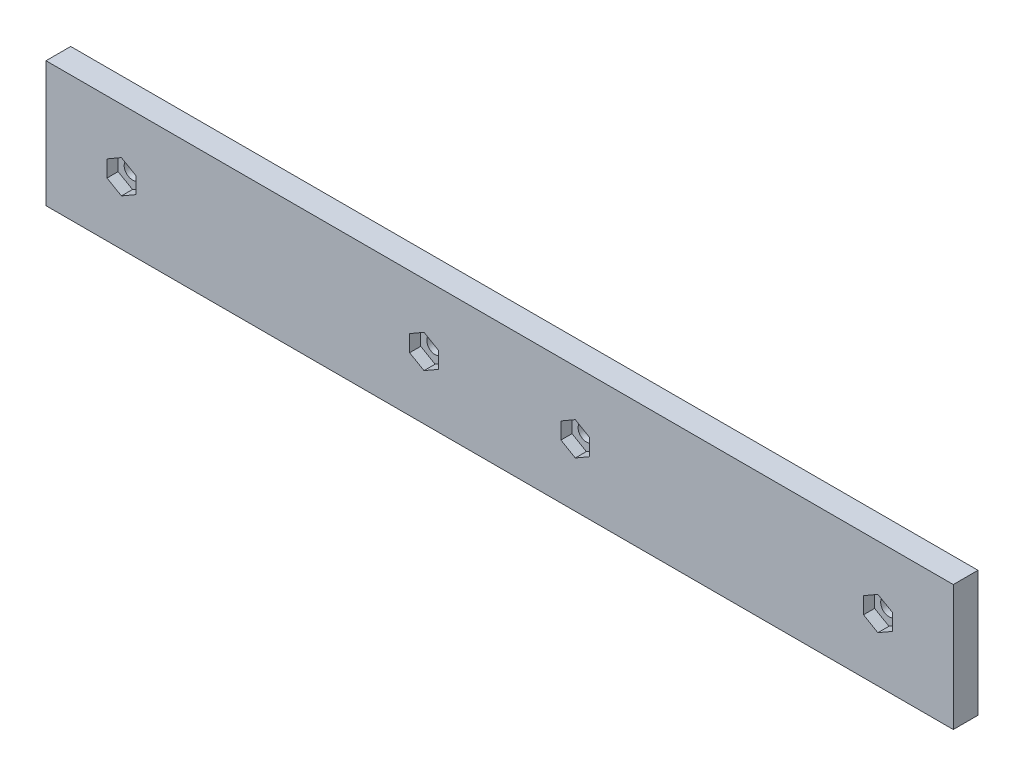
ISO-10303-21;
HEADER;
FILE_DESCRIPTION(('STEP AP214'),'2;1');
FILE_NAME('part.step','',(''),(''),'','','');
FILE_SCHEMA(('AUTOMOTIVE_DESIGN { 1 0 10303 214 1 1 1 1 }'));
ENDSEC;
DATA;
#1=APPLICATION_CONTEXT('core data for automotive mechanical design processes');
#2=APPLICATION_PROTOCOL_DEFINITION('international standard','automotive_design',2000,#1);
#3=PRODUCT_CONTEXT('',#1,'mechanical');
#4=PRODUCT('Part','Part','',(#3));
#5=PRODUCT_RELATED_PRODUCT_CATEGORY('part','',(#4));
#6=PRODUCT_DEFINITION_FORMATION('','',#4);
#7=PRODUCT_DEFINITION_CONTEXT('part definition',#1,'design');
#8=PRODUCT_DEFINITION('design','',#6,#7);
#9=PRODUCT_DEFINITION_SHAPE('','',#8);
#10=(LENGTH_UNIT() NAMED_UNIT(*) SI_UNIT(.MILLI.,.METRE.));
#11=(NAMED_UNIT(*) PLANE_ANGLE_UNIT() SI_UNIT($,.RADIAN.));
#12=(NAMED_UNIT(*) SI_UNIT($,.STERADIAN.) SOLID_ANGLE_UNIT());
#13=UNCERTAINTY_MEASURE_WITH_UNIT(LENGTH_MEASURE(1.E-05),#10,'distance_accuracy_value','');
#14=(GEOMETRIC_REPRESENTATION_CONTEXT(3) GLOBAL_UNCERTAINTY_ASSIGNED_CONTEXT((#13)) GLOBAL_UNIT_ASSIGNED_CONTEXT((#10,
#11,#12)) REPRESENTATION_CONTEXT('',''));
#15=CARTESIAN_POINT('',(0.,0.,0.));
#16=DIRECTION('',(0.,0.,1.));
#17=DIRECTION('',(1.,0.,0.));
#18=AXIS2_PLACEMENT_3D('',#15,#16,#17);
#19=CARTESIAN_POINT('',(205.907132516187,5.230027324618,4.9));
#20=DIRECTION('',(0.,0.,-1.));
#21=DIRECTION('',(-1.,0.,0.));
#22=AXIS2_PLACEMENT_3D('',#19,#20,#21);
#23=CYLINDRICAL_SURFACE('',#22,1.64999999999999);
#24=CARTESIAN_POINT('',(205.907132516187,5.230027324618,0.));
#25=DIRECTION('',(0.,0.,1.));
#26=DIRECTION('',(1.,0.,0.));
#27=AXIS2_PLACEMENT_3D('',#24,#25,#26);
#28=CIRCLE('',#27,1.64999999999999);
#29=CARTESIAN_POINT('',(207.557132516187,5.230027324618,0.));
#30=VERTEX_POINT('',#29);
#31=EDGE_CURVE('E430',#30,#30,#28,.T.);
#32=ORIENTED_EDGE('',*,*,#31,.F.);
#33=EDGE_LOOP('',(#32));
#34=FACE_BOUND('',#33,.T.);
#35=CARTESIAN_POINT('',(205.907132516187,5.230027324618,2.7));
#36=DIRECTION('',(0.,0.,1.));
#37=DIRECTION('',(1.,0.,0.));
#38=AXIS2_PLACEMENT_3D('',#35,#36,#37);
#39=CIRCLE('',#38,1.64999999999999);
#40=CARTESIAN_POINT('',(207.557132516187,5.230027324618,2.7));
#41=VERTEX_POINT('',#40);
#42=EDGE_CURVE('E39',#41,#41,#39,.T.);
#43=ORIENTED_EDGE('',*,*,#42,.T.);
#44=EDGE_LOOP('',(#43));
#45=FACE_BOUND('',#44,.T.);
#46=ADVANCED_FACE('F35',(#34,#45),#23,.F.);
#47=CARTESIAN_POINT('',(145.907132516185,5.230027324618,4.9));
#48=DIRECTION('',(0.,0.,-1.));
#49=DIRECTION('',(-1.,0.,0.));
#50=AXIS2_PLACEMENT_3D('',#47,#48,#49);
#51=CYLINDRICAL_SURFACE('',#50,1.64999999999999);
#52=CARTESIAN_POINT('',(145.907132516185,5.230027324618,0.));
#53=DIRECTION('',(0.,0.,1.));
#54=DIRECTION('',(1.,0.,0.));
#55=AXIS2_PLACEMENT_3D('',#52,#53,#54);
#56=CIRCLE('',#55,1.64999999999999);
#57=CARTESIAN_POINT('',(147.557132516185,5.230027324618,0.));
#58=VERTEX_POINT('',#57);
#59=EDGE_CURVE('E427',#58,#58,#56,.T.);
#60=ORIENTED_EDGE('',*,*,#59,.F.);
#61=EDGE_LOOP('',(#60));
#62=FACE_BOUND('',#61,.T.);
#63=CARTESIAN_POINT('',(145.907132516185,5.230027324618,2.7));
#64=DIRECTION('',(0.,0.,1.));
#65=DIRECTION('',(1.,0.,0.));
#66=AXIS2_PLACEMENT_3D('',#63,#64,#65);
#67=CIRCLE('',#66,1.64999999999999);
#68=CARTESIAN_POINT('',(147.557132516185,5.230027324618,2.7));
#69=VERTEX_POINT('',#68);
#70=EDGE_CURVE('E313',#69,#69,#67,.T.);
#71=ORIENTED_EDGE('',*,*,#70,.T.);
#72=EDGE_LOOP('',(#71));
#73=FACE_BOUND('',#72,.T.);
#74=ADVANCED_FACE('F466',(#62,#73),#51,.F.);
#75=CARTESIAN_POINT('',(115.907132516213,5.230027324618,4.9));
#76=DIRECTION('',(0.,0.,-1.));
#77=DIRECTION('',(-1.,0.,0.));
#78=AXIS2_PLACEMENT_3D('',#75,#76,#77);
#79=CYLINDRICAL_SURFACE('',#78,1.64999999999999);
#80=CARTESIAN_POINT('',(115.907132516213,5.230027324618,0.));
#81=DIRECTION('',(0.,0.,1.));
#82=DIRECTION('',(1.,0.,0.));
#83=AXIS2_PLACEMENT_3D('',#80,#81,#82);
#84=CIRCLE('',#83,1.64999999999999);
#85=CARTESIAN_POINT('',(117.557132516213,5.230027324618,0.));
#86=VERTEX_POINT('',#85);
#87=EDGE_CURVE('E424',#86,#86,#84,.T.);
#88=ORIENTED_EDGE('',*,*,#87,.F.);
#89=EDGE_LOOP('',(#88));
#90=FACE_BOUND('',#89,.T.);
#91=CARTESIAN_POINT('',(115.907132516213,5.230027324618,2.7));
#92=DIRECTION('',(0.,0.,1.));
#93=DIRECTION('',(1.,0.,0.));
#94=AXIS2_PLACEMENT_3D('',#91,#92,#93);
#95=CIRCLE('',#94,1.64999999999999);
#96=CARTESIAN_POINT('',(117.557132516213,5.230027324618,2.7));
#97=VERTEX_POINT('',#96);
#98=EDGE_CURVE('E361',#97,#97,#95,.T.);
#99=ORIENTED_EDGE('',*,*,#98,.T.);
#100=EDGE_LOOP('',(#99));
#101=FACE_BOUND('',#100,.T.);
#102=ADVANCED_FACE('F538',(#90,#101),#79,.F.);
#103=CARTESIAN_POINT('',(55.9071325162108,5.230027324618,4.9));
#104=DIRECTION('',(0.,0.,-1.));
#105=DIRECTION('',(-1.,0.,0.));
#106=AXIS2_PLACEMENT_3D('',#103,#104,#105);
#107=CYLINDRICAL_SURFACE('',#106,1.65);
#108=CARTESIAN_POINT('',(55.9071325162108,5.230027324618,0.));
#109=DIRECTION('',(0.,0.,1.));
#110=DIRECTION('',(1.,0.,0.));
#111=AXIS2_PLACEMENT_3D('',#108,#109,#110);
#112=CIRCLE('',#111,1.65);
#113=CARTESIAN_POINT('',(57.5571325162108,5.230027324618,0.));
#114=VERTEX_POINT('',#113);
#115=EDGE_CURVE('E421',#114,#114,#112,.T.);
#116=ORIENTED_EDGE('',*,*,#115,.F.);
#117=EDGE_LOOP('',(#116));
#118=FACE_BOUND('',#117,.T.);
#119=CARTESIAN_POINT('',(55.9071325162108,5.230027324618,2.7));
#120=DIRECTION('',(0.,0.,1.));
#121=DIRECTION('',(1.,0.,0.));
#122=AXIS2_PLACEMENT_3D('',#119,#120,#121);
#123=CIRCLE('',#122,1.65);
#124=CARTESIAN_POINT('',(57.5571325162108,5.230027324618,2.7));
#125=VERTEX_POINT('',#124);
#126=EDGE_CURVE('E410',#125,#125,#123,.T.);
#127=ORIENTED_EDGE('',*,*,#126,.T.);
#128=EDGE_LOOP('',(#127));
#129=FACE_BOUND('',#128,.T.);
#130=ADVANCED_FACE('F499',(#118,#129),#107,.F.);
#131=CARTESIAN_POINT('',(0.,0.,4.9));
#132=DIRECTION('',(0.,0.,1.));
#133=DIRECTION('',(1.,0.,0.));
#134=AXIS2_PLACEMENT_3D('',#131,#132,#133);
#135=PLANE('',#134);
#136=DIRECTION('',(0.866025403784439,0.5,0.));
#137=VECTOR('',#136,1.);
#138=CARTESIAN_POINT('',(205.907132516187,1.93913079023713,4.9));
#139=LINE('',#138,#137);
#140=CARTESIAN_POINT('',(205.907132516187,1.93913079023713,4.9));
#141=VERTEX_POINT('',#140);
#142=CARTESIAN_POINT('',(208.757132516187,3.58457905742758,4.9));
#143=VERTEX_POINT('',#142);
#144=EDGE_CURVE('E52',#141,#143,#139,.T.);
#145=ORIENTED_EDGE('',*,*,#144,.F.);
#146=DIRECTION('',(0.866025403784438,-0.5,0.));
#147=VECTOR('',#146,1.);
#148=CARTESIAN_POINT('',(203.057132516187,3.58457905742758,4.9));
#149=LINE('',#148,#147);
#150=CARTESIAN_POINT('',(203.057132516187,3.58457905742758,4.9));
#151=VERTEX_POINT('',#150);
#152=EDGE_CURVE('E243',#151,#141,#149,.T.);
#153=ORIENTED_EDGE('',*,*,#152,.F.);
#154=DIRECTION('',(0.,-1.,0.));
#155=VECTOR('',#154,1.);
#156=CARTESIAN_POINT('',(203.057132516187,6.87547559180849,4.9));
#157=LINE('',#156,#155);
#158=CARTESIAN_POINT('',(203.057132516187,6.87547559180849,4.9));
#159=VERTEX_POINT('',#158);
#160=EDGE_CURVE('E246',#159,#151,#157,.T.);
#161=ORIENTED_EDGE('',*,*,#160,.F.);
#162=DIRECTION('',(-0.866025403784439,-0.499999999999999,0.));
#163=VECTOR('',#162,1.);
#164=CARTESIAN_POINT('',(205.907132516187,8.52092385899894,4.9));
#165=LINE('',#164,#163);
#166=CARTESIAN_POINT('',(205.907132516187,8.52092385899894,4.9));
#167=VERTEX_POINT('',#166);
#168=EDGE_CURVE('E262',#167,#159,#165,.T.);
#169=ORIENTED_EDGE('',*,*,#168,.F.);
#170=DIRECTION('',(-0.866025403784438,0.500000000000001,0.));
#171=VECTOR('',#170,1.);
#172=CARTESIAN_POINT('',(208.757132516187,6.87547559180851,4.9));
#173=LINE('',#172,#171);
#174=CARTESIAN_POINT('',(208.757132516187,6.87547559180851,4.9));
#175=VERTEX_POINT('',#174);
#176=EDGE_CURVE('E259',#175,#167,#173,.T.);
#177=ORIENTED_EDGE('',*,*,#176,.F.);
#178=DIRECTION('',(0.,1.,0.));
#179=VECTOR('',#178,1.);
#180=CARTESIAN_POINT('',(208.757132516187,3.58457905742758,4.9));
#181=LINE('',#180,#179);
#182=EDGE_CURVE('E257',#143,#175,#181,.T.);
#183=ORIENTED_EDGE('',*,*,#182,.F.);
#184=EDGE_LOOP('',(#145,#153,#161,#169,#177,#183));
#185=FACE_BOUND('',#184,.T.);
#186=DIRECTION('',(0.866025403784439,0.499999999999999,0.));
#187=VECTOR('',#186,1.);
#188=CARTESIAN_POINT('',(145.907132516185,1.93913079023716,4.9));
#189=LINE('',#188,#187);
#190=CARTESIAN_POINT('',(145.907132516185,1.93913079023716,4.9));
#191=VERTEX_POINT('',#190);
#192=CARTESIAN_POINT('',(148.757132516185,3.58457905742758,4.9));
#193=VERTEX_POINT('',#192);
#194=EDGE_CURVE('E60',#191,#193,#189,.T.);
#195=ORIENTED_EDGE('',*,*,#194,.F.);
#196=DIRECTION('',(0.866025403784438,-0.500000000000001,0.));
#197=VECTOR('',#196,1.);
#198=CARTESIAN_POINT('',(143.057132516185,3.58457905742758,4.9));
#199=LINE('',#198,#197);
#200=CARTESIAN_POINT('',(143.057132516185,3.58457905742758,4.9));
#201=VERTEX_POINT('',#200);
#202=EDGE_CURVE('E280',#201,#191,#199,.T.);
#203=ORIENTED_EDGE('',*,*,#202,.F.);
#204=DIRECTION('',(0.,-1.,0.));
#205=VECTOR('',#204,1.);
#206=CARTESIAN_POINT('',(143.057132516185,6.87547559180841,4.9));
#207=LINE('',#206,#205);
#208=CARTESIAN_POINT('',(143.057132516185,6.87547559180841,4.9));
#209=VERTEX_POINT('',#208);
#210=EDGE_CURVE('E306',#209,#201,#207,.T.);
#211=ORIENTED_EDGE('',*,*,#210,.F.);
#212=DIRECTION('',(-0.866025403784439,-0.5,0.));
#213=VECTOR('',#212,1.);
#214=CARTESIAN_POINT('',(145.907132516185,8.52092385899882,4.9));
#215=LINE('',#214,#213);
#216=CARTESIAN_POINT('',(145.907132516185,8.52092385899882,4.9));
#217=VERTEX_POINT('',#216);
#218=EDGE_CURVE('E303',#217,#209,#215,.T.);
#219=ORIENTED_EDGE('',*,*,#218,.F.);
#220=DIRECTION('',(-0.866025403784439,0.5,0.));
#221=VECTOR('',#220,1.);
#222=CARTESIAN_POINT('',(148.757132516185,6.8754755918084,4.9));
#223=LINE('',#222,#221);
#224=CARTESIAN_POINT('',(148.757132516185,6.8754755918084,4.9));
#225=VERTEX_POINT('',#224);
#226=EDGE_CURVE('E300',#225,#217,#223,.T.);
#227=ORIENTED_EDGE('',*,*,#226,.F.);
#228=DIRECTION('',(0.,1.,0.));
#229=VECTOR('',#228,1.);
#230=CARTESIAN_POINT('',(148.757132516185,3.58457905742758,4.9));
#231=LINE('',#230,#229);
#232=EDGE_CURVE('E297',#193,#225,#231,.T.);
#233=ORIENTED_EDGE('',*,*,#232,.F.);
#234=EDGE_LOOP('',(#195,#203,#211,#219,#227,#233));
#235=FACE_BOUND('',#234,.T.);
#236=DIRECTION('',(0.866025403784439,0.5,0.));
#237=VECTOR('',#236,1.);
#238=CARTESIAN_POINT('',(115.907132516213,1.93913079023714,4.9));
#239=LINE('',#238,#237);
#240=CARTESIAN_POINT('',(115.907132516213,1.93913079023714,4.9));
#241=VERTEX_POINT('',#240);
#242=CARTESIAN_POINT('',(118.757132516213,3.58457905742758,4.9));
#243=VERTEX_POINT('',#242);
#244=EDGE_CURVE('E343',#241,#243,#239,.T.);
#245=ORIENTED_EDGE('',*,*,#244,.F.);
#246=DIRECTION('',(0.866025403784438,-0.5,0.));
#247=VECTOR('',#246,1.);
#248=CARTESIAN_POINT('',(113.057132516213,3.58457905742757,4.9));
#249=LINE('',#248,#247);
#250=CARTESIAN_POINT('',(113.057132516213,3.58457905742757,4.9));
#251=VERTEX_POINT('',#250);
#252=EDGE_CURVE('E327',#251,#241,#249,.T.);
#253=ORIENTED_EDGE('',*,*,#252,.F.);
#254=DIRECTION('',(0.,-1.,0.));
#255=VECTOR('',#254,1.);
#256=CARTESIAN_POINT('',(113.057132516213,6.87547559180845,4.9));
#257=LINE('',#256,#255);
#258=CARTESIAN_POINT('',(113.057132516213,6.87547559180845,4.9));
#259=VERTEX_POINT('',#258);
#260=EDGE_CURVE('E354',#259,#251,#257,.T.);
#261=ORIENTED_EDGE('',*,*,#260,.F.);
#262=DIRECTION('',(-0.866025403784439,-0.5,0.));
#263=VECTOR('',#262,1.);
#264=CARTESIAN_POINT('',(115.907132516213,8.5209238589989,4.9));
#265=LINE('',#264,#263);
#266=CARTESIAN_POINT('',(115.907132516213,8.5209238589989,4.9));
#267=VERTEX_POINT('',#266);
#268=EDGE_CURVE('E351',#267,#259,#265,.T.);
#269=ORIENTED_EDGE('',*,*,#268,.F.);
#270=DIRECTION('',(-0.866025403784438,0.5,0.));
#271=VECTOR('',#270,1.);
#272=CARTESIAN_POINT('',(118.757132516213,6.87547559180846,4.9));
#273=LINE('',#272,#271);
#274=CARTESIAN_POINT('',(118.757132516213,6.87547559180846,4.9));
#275=VERTEX_POINT('',#274);
#276=EDGE_CURVE('E348',#275,#267,#273,.T.);
#277=ORIENTED_EDGE('',*,*,#276,.F.);
#278=DIRECTION('',(0.,1.,0.));
#279=VECTOR('',#278,1.);
#280=CARTESIAN_POINT('',(118.757132516213,3.58457905742758,4.9));
#281=LINE('',#280,#279);
#282=EDGE_CURVE('E345',#243,#275,#281,.T.);
#283=ORIENTED_EDGE('',*,*,#282,.F.);
#284=EDGE_LOOP('',(#245,#253,#261,#269,#277,#283));
#285=FACE_BOUND('',#284,.T.);
#286=DIRECTION('',(0.866025403784438,0.5,0.));
#287=VECTOR('',#286,1.);
#288=CARTESIAN_POINT('',(55.9071325162108,1.93913079023713,4.9));
#289=LINE('',#288,#287);
#290=CARTESIAN_POINT('',(55.9071325162108,1.93913079023713,4.9));
#291=VERTEX_POINT('',#290);
#292=CARTESIAN_POINT('',(58.7571325162108,3.58457905742757,4.9));
#293=VERTEX_POINT('',#292);
#294=EDGE_CURVE('E392',#291,#293,#289,.T.);
#295=ORIENTED_EDGE('',*,*,#294,.F.);
#296=DIRECTION('',(0.866025403784439,-0.5,0.));
#297=VECTOR('',#296,1.);
#298=CARTESIAN_POINT('',(53.0571325162108,3.58457905742756,4.9));
#299=LINE('',#298,#297);
#300=CARTESIAN_POINT('',(53.0571325162108,3.58457905742756,4.9));
#301=VERTEX_POINT('',#300);
#302=EDGE_CURVE('E376',#301,#291,#299,.T.);
#303=ORIENTED_EDGE('',*,*,#302,.F.);
#304=DIRECTION('',(0.,-1.,0.));
#305=VECTOR('',#304,1.);
#306=CARTESIAN_POINT('',(53.0571325162108,6.87547559180844,4.9));
#307=LINE('',#306,#305);
#308=CARTESIAN_POINT('',(53.0571325162108,6.87547559180844,4.9));
#309=VERTEX_POINT('',#308);
#310=EDGE_CURVE('E403',#309,#301,#307,.T.);
#311=ORIENTED_EDGE('',*,*,#310,.F.);
#312=DIRECTION('',(-0.866025403784439,-0.5,0.));
#313=VECTOR('',#312,1.);
#314=CARTESIAN_POINT('',(55.9071325162108,8.52092385899887,4.9));
#315=LINE('',#314,#313);
#316=CARTESIAN_POINT('',(55.9071325162108,8.52092385899887,4.9));
#317=VERTEX_POINT('',#316);
#318=EDGE_CURVE('E400',#317,#309,#315,.T.);
#319=ORIENTED_EDGE('',*,*,#318,.F.);
#320=DIRECTION('',(-0.866025403784438,0.5,0.));
#321=VECTOR('',#320,1.);
#322=CARTESIAN_POINT('',(58.7571325162108,6.87547559180843,4.9));
#323=LINE('',#322,#321);
#324=CARTESIAN_POINT('',(58.7571325162108,6.87547559180843,4.9));
#325=VERTEX_POINT('',#324);
#326=EDGE_CURVE('E397',#325,#317,#323,.T.);
#327=ORIENTED_EDGE('',*,*,#326,.F.);
#328=DIRECTION('',(0.,1.,0.));
#329=VECTOR('',#328,1.);
#330=CARTESIAN_POINT('',(58.7571325162108,3.58457905742757,4.9));
#331=LINE('',#330,#329);
#332=EDGE_CURVE('E394',#293,#325,#331,.T.);
#333=ORIENTED_EDGE('',*,*,#332,.F.);
#334=EDGE_LOOP('',(#295,#303,#311,#319,#327,#333));
#335=FACE_BOUND('',#334,.T.);
#336=DIRECTION('',(0.,1.,0.));
#337=VECTOR('',#336,1.);
#338=CARTESIAN_POINT('',(220.857132516199,-7.21997267538202,4.9));
#339=LINE('',#338,#337);
#340=CARTESIAN_POINT('',(220.857132516199,-7.21997267538202,4.9));
#341=VERTEX_POINT('',#340);
#342=CARTESIAN_POINT('',(220.857132516199,17.680027324618,4.9));
#343=VERTEX_POINT('',#342);
#344=EDGE_CURVE('E434',#341,#343,#339,.T.);
#345=ORIENTED_EDGE('',*,*,#344,.T.);
#346=DIRECTION('',(-1.,0.,0.));
#347=VECTOR('',#346,1.);
#348=CARTESIAN_POINT('',(220.857132516199,17.680027324618,4.9));
#349=LINE('',#348,#347);
#350=CARTESIAN_POINT('',(40.9571325161992,17.680027324618,4.9));
#351=VERTEX_POINT('',#350);
#352=EDGE_CURVE('E437',#343,#351,#349,.T.);
#353=ORIENTED_EDGE('',*,*,#352,.T.);
#354=DIRECTION('',(0.,-1.,0.));
#355=VECTOR('',#354,1.);
#356=CARTESIAN_POINT('',(40.9571325161992,-7.21997267538202,4.9));
#357=LINE('',#356,#355);
#358=CARTESIAN_POINT('',(40.9571325161992,-7.21997267538202,4.9));
#359=VERTEX_POINT('',#358);
#360=EDGE_CURVE('E440',#351,#359,#357,.T.);
#361=ORIENTED_EDGE('',*,*,#360,.T.);
#362=DIRECTION('',(1.,0.,0.));
#363=VECTOR('',#362,1.);
#364=CARTESIAN_POINT('',(220.857132516199,-7.21997267538202,4.9));
#365=LINE('',#364,#363);
#366=EDGE_CURVE('E442',#359,#341,#365,.T.);
#367=ORIENTED_EDGE('',*,*,#366,.T.);
#368=EDGE_LOOP('',(#345,#353,#361,#367));
#369=FACE_BOUND('',#368,.T.);
#370=ADVANCED_FACE('F495',(#185,#235,#285,#335,#369),#135,.T.);
#371=CARTESIAN_POINT('',(0.,0.,0.));
#372=DIRECTION('',(0.,0.,1.));
#373=DIRECTION('',(1.,0.,0.));
#374=AXIS2_PLACEMENT_3D('',#371,#372,#373);
#375=PLANE('',#374);
#376=ORIENTED_EDGE('',*,*,#87,.T.);
#377=EDGE_LOOP('',(#376));
#378=FACE_BOUND('',#377,.T.);
#379=ORIENTED_EDGE('',*,*,#31,.T.);
#380=EDGE_LOOP('',(#379));
#381=FACE_BOUND('',#380,.T.);
#382=DIRECTION('',(0.,1.,0.));
#383=VECTOR('',#382,1.);
#384=CARTESIAN_POINT('',(220.857132516199,-7.21997267538202,0.));
#385=LINE('',#384,#383);
#386=CARTESIAN_POINT('',(220.857132516199,-7.21997267538202,0.));
#387=VERTEX_POINT('',#386);
#388=CARTESIAN_POINT('',(220.857132516199,17.680027324618,0.));
#389=VERTEX_POINT('',#388);
#390=EDGE_CURVE('E433',#387,#389,#385,.T.);
#391=ORIENTED_EDGE('',*,*,#390,.F.);
#392=DIRECTION('',(1.,0.,0.));
#393=VECTOR('',#392,1.);
#394=CARTESIAN_POINT('',(220.857132516199,-7.21997267538202,0.));
#395=LINE('',#394,#393);
#396=CARTESIAN_POINT('',(40.9571325161992,-7.21997267538202,0.));
#397=VERTEX_POINT('',#396);
#398=EDGE_CURVE('E438',#397,#387,#395,.T.);
#399=ORIENTED_EDGE('',*,*,#398,.F.);
#400=DIRECTION('',(0.,-1.,0.));
#401=VECTOR('',#400,1.);
#402=CARTESIAN_POINT('',(40.9571325161992,-7.21997267538202,0.));
#403=LINE('',#402,#401);
#404=CARTESIAN_POINT('',(40.9571325161992,17.680027324618,0.));
#405=VERTEX_POINT('',#404);
#406=EDGE_CURVE('E450',#405,#397,#403,.T.);
#407=ORIENTED_EDGE('',*,*,#406,.F.);
#408=DIRECTION('',(-1.,0.,0.));
#409=VECTOR('',#408,1.);
#410=CARTESIAN_POINT('',(220.857132516199,17.680027324618,0.));
#411=LINE('',#410,#409);
#412=EDGE_CURVE('E448',#389,#405,#411,.T.);
#413=ORIENTED_EDGE('',*,*,#412,.F.);
#414=EDGE_LOOP('',(#391,#399,#407,#413));
#415=FACE_BOUND('',#414,.T.);
#416=ORIENTED_EDGE('',*,*,#59,.T.);
#417=EDGE_LOOP('',(#416));
#418=FACE_BOUND('',#417,.T.);
#419=ORIENTED_EDGE('',*,*,#115,.T.);
#420=EDGE_LOOP('',(#419));
#421=FACE_BOUND('',#420,.T.);
#422=ADVANCED_FACE('F498',(#378,#381,#415,#418,#421),#375,.F.);
#423=CARTESIAN_POINT('',(220.857132516199,-7.21997267538202,4.9));
#424=DIRECTION('',(-1.,0.,0.));
#425=DIRECTION('',(0.,0.,1.));
#426=AXIS2_PLACEMENT_3D('',#423,#424,#425);
#427=PLANE('',#426);
#428=ORIENTED_EDGE('',*,*,#390,.T.);
#429=DIRECTION('',(0.,0.,-1.));
#430=VECTOR('',#429,1.);
#431=CARTESIAN_POINT('',(220.857132516199,17.680027324618,4.9));
#432=LINE('',#431,#430);
#433=EDGE_CURVE('E11',#343,#389,#432,.T.);
#434=ORIENTED_EDGE('',*,*,#433,.F.);
#435=ORIENTED_EDGE('',*,*,#344,.F.);
#436=DIRECTION('',(0.,0.,-1.));
#437=VECTOR('',#436,1.);
#438=CARTESIAN_POINT('',(220.857132516199,-7.21997267538202,4.9));
#439=LINE('',#438,#437);
#440=EDGE_CURVE('E445',#341,#387,#439,.T.);
#441=ORIENTED_EDGE('',*,*,#440,.T.);
#442=EDGE_LOOP('',(#428,#434,#435,#441));
#443=FACE_BOUND('',#442,.T.);
#444=ADVANCED_FACE('F37',(#443),#427,.F.);
#445=CARTESIAN_POINT('',(220.857132516199,17.680027324618,4.9));
#446=DIRECTION('',(0.,-1.,0.));
#447=DIRECTION('',(0.,0.,-1.));
#448=AXIS2_PLACEMENT_3D('',#445,#446,#447);
#449=PLANE('',#448);
#450=ORIENTED_EDGE('',*,*,#412,.T.);
#451=DIRECTION('',(0.,0.,-1.));
#452=VECTOR('',#451,1.);
#453=CARTESIAN_POINT('',(40.9571325161992,17.680027324618,4.9));
#454=LINE('',#453,#452);
#455=EDGE_CURVE('E44',#351,#405,#454,.T.);
#456=ORIENTED_EDGE('',*,*,#455,.F.);
#457=ORIENTED_EDGE('',*,*,#352,.F.);
#458=ORIENTED_EDGE('',*,*,#433,.T.);
#459=EDGE_LOOP('',(#450,#456,#457,#458));
#460=FACE_BOUND('',#459,.T.);
#461=ADVANCED_FACE('F518',(#460),#449,.F.);
#462=CARTESIAN_POINT('',(40.9571325161992,-7.21997267538202,4.9));
#463=DIRECTION('',(1.,0.,0.));
#464=DIRECTION('',(0.,0.,-1.));
#465=AXIS2_PLACEMENT_3D('',#462,#463,#464);
#466=PLANE('',#465);
#467=ORIENTED_EDGE('',*,*,#406,.T.);
#468=DIRECTION('',(0.,0.,-1.));
#469=VECTOR('',#468,1.);
#470=CARTESIAN_POINT('',(40.9571325161992,-7.21997267538202,4.9));
#471=LINE('',#470,#469);
#472=EDGE_CURVE('E455',#359,#397,#471,.T.);
#473=ORIENTED_EDGE('',*,*,#472,.F.);
#474=ORIENTED_EDGE('',*,*,#360,.F.);
#475=ORIENTED_EDGE('',*,*,#455,.T.);
#476=EDGE_LOOP('',(#467,#473,#474,#475));
#477=FACE_BOUND('',#476,.T.);
#478=ADVANCED_FACE('F523',(#477),#466,.F.);
#479=CARTESIAN_POINT('',(220.857132516199,-7.21997267538202,4.9));
#480=DIRECTION('',(0.,1.,0.));
#481=DIRECTION('',(0.,0.,1.));
#482=AXIS2_PLACEMENT_3D('',#479,#480,#481);
#483=PLANE('',#482);
#484=ORIENTED_EDGE('',*,*,#398,.T.);
#485=ORIENTED_EDGE('',*,*,#440,.F.);
#486=ORIENTED_EDGE('',*,*,#366,.F.);
#487=ORIENTED_EDGE('',*,*,#472,.T.);
#488=EDGE_LOOP('',(#484,#485,#486,#487));
#489=FACE_BOUND('',#488,.T.);
#490=ADVANCED_FACE('F526',(#489),#483,.F.);
#491=CARTESIAN_POINT('',(55.9071325162108,1.93913079023713,2.7));
#492=DIRECTION('',(0.5,-0.866025403784439,0.));
#493=DIRECTION('',(0.866025403784438,0.5,0.));
#494=AXIS2_PLACEMENT_3D('',#491,#492,#493);
#495=PLANE('',#494);
#496=ORIENTED_EDGE('',*,*,#294,.T.);
#497=DIRECTION('',(0.,0.,1.));
#498=VECTOR('',#497,1.);
#499=CARTESIAN_POINT('',(58.7571325162108,3.58457905742757,2.7));
#500=LINE('',#499,#498);
#501=CARTESIAN_POINT('',(58.7571325162108,3.58457905742757,2.7));
#502=VERTEX_POINT('',#501);
#503=EDGE_CURVE('E391',#502,#293,#500,.T.);
#504=ORIENTED_EDGE('',*,*,#503,.F.);
#505=DIRECTION('',(0.866025403784438,0.5,0.));
#506=VECTOR('',#505,1.);
#507=CARTESIAN_POINT('',(55.9071325162108,1.93913079023713,2.7));
#508=LINE('',#507,#506);
#509=CARTESIAN_POINT('',(55.9071325162108,1.93913079023713,2.7));
#510=VERTEX_POINT('',#509);
#511=EDGE_CURVE('E372',#510,#502,#508,.T.);
#512=ORIENTED_EDGE('',*,*,#511,.F.);
#513=DIRECTION('',(0.,0.,1.));
#514=VECTOR('',#513,1.);
#515=CARTESIAN_POINT('',(55.9071325162108,1.93913079023713,2.7));
#516=LINE('',#515,#514);
#517=EDGE_CURVE('E408',#510,#291,#516,.T.);
#518=ORIENTED_EDGE('',*,*,#517,.T.);
#519=EDGE_LOOP('',(#496,#504,#512,#518));
#520=FACE_BOUND('',#519,.T.);
#521=ADVANCED_FACE('F552',(#520),#495,.F.);
#522=CARTESIAN_POINT('',(53.0571325162108,3.58457905742756,2.7));
#523=DIRECTION('',(-0.5,-0.866025403784439,0.));
#524=DIRECTION('',(0.866025403784439,-0.5,0.));
#525=AXIS2_PLACEMENT_3D('',#522,#523,#524);
#526=PLANE('',#525);
#527=ORIENTED_EDGE('',*,*,#302,.T.);
#528=ORIENTED_EDGE('',*,*,#517,.F.);
#529=DIRECTION('',(0.866025403784439,-0.5,0.));
#530=VECTOR('',#529,1.);
#531=CARTESIAN_POINT('',(53.0571325162108,3.58457905742756,2.7));
#532=LINE('',#531,#530);
#533=CARTESIAN_POINT('',(53.0571325162108,3.58457905742756,2.7));
#534=VERTEX_POINT('',#533);
#535=EDGE_CURVE('E388',#534,#510,#532,.T.);
#536=ORIENTED_EDGE('',*,*,#535,.F.);
#537=DIRECTION('',(0.,0.,1.));
#538=VECTOR('',#537,1.);
#539=CARTESIAN_POINT('',(53.0571325162108,3.58457905742756,2.7));
#540=LINE('',#539,#538);
#541=EDGE_CURVE('E411',#534,#301,#540,.T.);
#542=ORIENTED_EDGE('',*,*,#541,.T.);
#543=EDGE_LOOP('',(#527,#528,#536,#542));
#544=FACE_BOUND('',#543,.T.);
#545=ADVANCED_FACE('F567',(#544),#526,.F.);
#546=CARTESIAN_POINT('',(53.0571325162108,6.87547559180844,2.7));
#547=DIRECTION('',(-1.,0.,0.));
#548=DIRECTION('',(0.,0.,1.));
#549=AXIS2_PLACEMENT_3D('',#546,#547,#548);
#550=PLANE('',#549);
#551=ORIENTED_EDGE('',*,*,#310,.T.);
#552=ORIENTED_EDGE('',*,*,#541,.F.);
#553=DIRECTION('',(0.,-1.,0.));
#554=VECTOR('',#553,1.);
#555=CARTESIAN_POINT('',(53.0571325162108,6.87547559180844,2.7));
#556=LINE('',#555,#554);
#557=CARTESIAN_POINT('',(53.0571325162108,6.87547559180844,2.7));
#558=VERTEX_POINT('',#557);
#559=EDGE_CURVE('E385',#558,#534,#556,.T.);
#560=ORIENTED_EDGE('',*,*,#559,.F.);
#561=DIRECTION('',(0.,0.,1.));
#562=VECTOR('',#561,1.);
#563=CARTESIAN_POINT('',(53.0571325162108,6.87547559180844,2.7));
#564=LINE('',#563,#562);
#565=EDGE_CURVE('E413',#558,#309,#564,.T.);
#566=ORIENTED_EDGE('',*,*,#565,.T.);
#567=EDGE_LOOP('',(#551,#552,#560,#566));
#568=FACE_BOUND('',#567,.T.);
#569=ADVANCED_FACE('F565',(#568),#550,.F.);
#570=CARTESIAN_POINT('',(55.9071325162108,8.52092385899887,2.7));
#571=DIRECTION('',(-0.5,0.866025403784439,0.));
#572=DIRECTION('',(-0.866025403784439,-0.5,0.));
#573=AXIS2_PLACEMENT_3D('',#570,#571,#572);
#574=PLANE('',#573);
#575=ORIENTED_EDGE('',*,*,#318,.T.);
#576=ORIENTED_EDGE('',*,*,#565,.F.);
#577=DIRECTION('',(-0.866025403784439,-0.5,0.));
#578=VECTOR('',#577,1.);
#579=CARTESIAN_POINT('',(55.9071325162108,8.52092385899887,2.7));
#580=LINE('',#579,#578);
#581=CARTESIAN_POINT('',(55.9071325162108,8.52092385899887,2.7));
#582=VERTEX_POINT('',#581);
#583=EDGE_CURVE('E382',#582,#558,#580,.T.);
#584=ORIENTED_EDGE('',*,*,#583,.F.);
#585=DIRECTION('',(0.,0.,1.));
#586=VECTOR('',#585,1.);
#587=CARTESIAN_POINT('',(55.9071325162108,8.52092385899887,2.7));
#588=LINE('',#587,#586);
#589=EDGE_CURVE('E415',#582,#317,#588,.T.);
#590=ORIENTED_EDGE('',*,*,#589,.T.);
#591=EDGE_LOOP('',(#575,#576,#584,#590));
#592=FACE_BOUND('',#591,.T.);
#593=ADVANCED_FACE('F561',(#592),#574,.F.);
#594=CARTESIAN_POINT('',(58.7571325162108,6.87547559180843,2.7));
#595=DIRECTION('',(0.5,0.866025403784439,0.));
#596=DIRECTION('',(-0.866025403784439,0.5,0.));
#597=AXIS2_PLACEMENT_3D('',#594,#595,#596);
#598=PLANE('',#597);
#599=ORIENTED_EDGE('',*,*,#326,.T.);
#600=ORIENTED_EDGE('',*,*,#589,.F.);
#601=DIRECTION('',(-0.866025403784438,0.5,0.));
#602=VECTOR('',#601,1.);
#603=CARTESIAN_POINT('',(58.7571325162108,6.87547559180843,2.7));
#604=LINE('',#603,#602);
#605=CARTESIAN_POINT('',(58.7571325162108,6.87547559180843,2.7));
#606=VERTEX_POINT('',#605);
#607=EDGE_CURVE('E379',#606,#582,#604,.T.);
#608=ORIENTED_EDGE('',*,*,#607,.F.);
#609=DIRECTION('',(0.,0.,1.));
#610=VECTOR('',#609,1.);
#611=CARTESIAN_POINT('',(58.7571325162108,6.87547559180843,2.7));
#612=LINE('',#611,#610);
#613=EDGE_CURVE('E417',#606,#325,#612,.T.);
#614=ORIENTED_EDGE('',*,*,#613,.T.);
#615=EDGE_LOOP('',(#599,#600,#608,#614));
#616=FACE_BOUND('',#615,.T.);
#617=ADVANCED_FACE('F557',(#616),#598,.F.);
#618=CARTESIAN_POINT('',(58.7571325162108,3.58457905742757,2.7));
#619=DIRECTION('',(1.,0.,0.));
#620=DIRECTION('',(0.,0.,-1.));
#621=AXIS2_PLACEMENT_3D('',#618,#619,#620);
#622=PLANE('',#621);
#623=ORIENTED_EDGE('',*,*,#332,.T.);
#624=ORIENTED_EDGE('',*,*,#613,.F.);
#625=DIRECTION('',(0.,1.,0.));
#626=VECTOR('',#625,1.);
#627=CARTESIAN_POINT('',(58.7571325162108,3.58457905742757,2.7));
#628=LINE('',#627,#626);
#629=EDGE_CURVE('E375',#502,#606,#628,.T.);
#630=ORIENTED_EDGE('',*,*,#629,.F.);
#631=ORIENTED_EDGE('',*,*,#503,.T.);
#632=EDGE_LOOP('',(#623,#624,#630,#631));
#633=FACE_BOUND('',#632,.T.);
#634=ADVANCED_FACE('F546',(#633),#622,.F.);
#635=CARTESIAN_POINT('',(0.,0.,2.7));
#636=DIRECTION('',(0.,0.,1.));
#637=DIRECTION('',(1.,0.,0.));
#638=AXIS2_PLACEMENT_3D('',#635,#636,#637);
#639=PLANE('',#638);
#640=ORIENTED_EDGE('',*,*,#126,.F.);
#641=EDGE_LOOP('',(#640));
#642=FACE_BOUND('',#641,.T.);
#643=ORIENTED_EDGE('',*,*,#511,.T.);
#644=ORIENTED_EDGE('',*,*,#629,.T.);
#645=ORIENTED_EDGE('',*,*,#607,.T.);
#646=ORIENTED_EDGE('',*,*,#583,.T.);
#647=ORIENTED_EDGE('',*,*,#559,.T.);
#648=ORIENTED_EDGE('',*,*,#535,.T.);
#649=EDGE_LOOP('',(#643,#644,#645,#646,#647,#648));
#650=FACE_BOUND('',#649,.T.);
#651=ADVANCED_FACE('F542',(#642,#650),#639,.T.);
#652=CARTESIAN_POINT('',(115.907132516213,1.93913079023714,2.7));
#653=DIRECTION('',(0.5,-0.866025403784439,0.));
#654=DIRECTION('',(0.866025403784439,0.5,0.));
#655=AXIS2_PLACEMENT_3D('',#652,#653,#654);
#656=PLANE('',#655);
#657=ORIENTED_EDGE('',*,*,#244,.T.);
#658=DIRECTION('',(0.,0.,1.));
#659=VECTOR('',#658,1.);
#660=CARTESIAN_POINT('',(118.757132516213,3.58457905742758,2.7));
#661=LINE('',#660,#659);
#662=CARTESIAN_POINT('',(118.757132516213,3.58457905742758,2.7));
#663=VERTEX_POINT('',#662);
#664=EDGE_CURVE('E342',#663,#243,#661,.T.);
#665=ORIENTED_EDGE('',*,*,#664,.F.);
#666=DIRECTION('',(0.866025403784439,0.5,0.));
#667=VECTOR('',#666,1.);
#668=CARTESIAN_POINT('',(115.907132516213,1.93913079023714,2.7));
#669=LINE('',#668,#667);
#670=CARTESIAN_POINT('',(115.907132516213,1.93913079023714,2.7));
#671=VERTEX_POINT('',#670);
#672=EDGE_CURVE('E323',#671,#663,#669,.T.);
#673=ORIENTED_EDGE('',*,*,#672,.F.);
#674=DIRECTION('',(0.,0.,1.));
#675=VECTOR('',#674,1.);
#676=CARTESIAN_POINT('',(115.907132516213,1.93913079023714,2.7));
#677=LINE('',#676,#675);
#678=EDGE_CURVE('E359',#671,#241,#677,.T.);
#679=ORIENTED_EDGE('',*,*,#678,.T.);
#680=EDGE_LOOP('',(#657,#665,#673,#679));
#681=FACE_BOUND('',#680,.T.);
#682=ADVANCED_FACE('F545',(#681),#656,.F.);
#683=CARTESIAN_POINT('',(113.057132516213,3.58457905742757,2.7));
#684=DIRECTION('',(-0.5,-0.866025403784439,0.));
#685=DIRECTION('',(0.866025403784439,-0.5,0.));
#686=AXIS2_PLACEMENT_3D('',#683,#684,#685);
#687=PLANE('',#686);
#688=ORIENTED_EDGE('',*,*,#252,.T.);
#689=ORIENTED_EDGE('',*,*,#678,.F.);
#690=DIRECTION('',(0.866025403784438,-0.5,0.));
#691=VECTOR('',#690,1.);
#692=CARTESIAN_POINT('',(113.057132516213,3.58457905742757,2.7));
#693=LINE('',#692,#691);
#694=CARTESIAN_POINT('',(113.057132516213,3.58457905742757,2.7));
#695=VERTEX_POINT('',#694);
#696=EDGE_CURVE('E339',#695,#671,#693,.T.);
#697=ORIENTED_EDGE('',*,*,#696,.F.);
#698=DIRECTION('',(0.,0.,1.));
#699=VECTOR('',#698,1.);
#700=CARTESIAN_POINT('',(113.057132516213,3.58457905742757,2.7));
#701=LINE('',#700,#699);
#702=EDGE_CURVE('E362',#695,#251,#701,.T.);
#703=ORIENTED_EDGE('',*,*,#702,.T.);
#704=EDGE_LOOP('',(#688,#689,#697,#703));
#705=FACE_BOUND('',#704,.T.);
#706=ADVANCED_FACE('F700',(#705),#687,.F.);
#707=CARTESIAN_POINT('',(113.057132516213,6.87547559180845,2.7));
#708=DIRECTION('',(-1.,0.,0.));
#709=DIRECTION('',(0.,0.,1.));
#710=AXIS2_PLACEMENT_3D('',#707,#708,#709);
#711=PLANE('',#710);
#712=ORIENTED_EDGE('',*,*,#260,.T.);
#713=ORIENTED_EDGE('',*,*,#702,.F.);
#714=DIRECTION('',(0.,-1.,0.));
#715=VECTOR('',#714,1.);
#716=CARTESIAN_POINT('',(113.057132516213,6.87547559180845,2.7));
#717=LINE('',#716,#715);
#718=CARTESIAN_POINT('',(113.057132516213,6.87547559180845,2.7));
#719=VERTEX_POINT('',#718);
#720=EDGE_CURVE('E336',#719,#695,#717,.T.);
#721=ORIENTED_EDGE('',*,*,#720,.F.);
#722=DIRECTION('',(0.,0.,1.));
#723=VECTOR('',#722,1.);
#724=CARTESIAN_POINT('',(113.057132516213,6.87547559180845,2.7));
#725=LINE('',#724,#723);
#726=EDGE_CURVE('E364',#719,#259,#725,.T.);
#727=ORIENTED_EDGE('',*,*,#726,.T.);
#728=EDGE_LOOP('',(#712,#713,#721,#727));
#729=FACE_BOUND('',#728,.T.);
#730=ADVANCED_FACE('F710',(#729),#711,.F.);
#731=CARTESIAN_POINT('',(115.907132516213,8.5209238589989,2.7));
#732=DIRECTION('',(-0.5,0.866025403784439,0.));
#733=DIRECTION('',(-0.866025403784439,-0.5,0.));
#734=AXIS2_PLACEMENT_3D('',#731,#732,#733);
#735=PLANE('',#734);
#736=ORIENTED_EDGE('',*,*,#268,.T.);
#737=ORIENTED_EDGE('',*,*,#726,.F.);
#738=DIRECTION('',(-0.866025403784439,-0.5,0.));
#739=VECTOR('',#738,1.);
#740=CARTESIAN_POINT('',(115.907132516213,8.5209238589989,2.7));
#741=LINE('',#740,#739);
#742=CARTESIAN_POINT('',(115.907132516213,8.5209238589989,2.7));
#743=VERTEX_POINT('',#742);
#744=EDGE_CURVE('E333',#743,#719,#741,.T.);
#745=ORIENTED_EDGE('',*,*,#744,.F.);
#746=DIRECTION('',(0.,0.,1.));
#747=VECTOR('',#746,1.);
#748=CARTESIAN_POINT('',(115.907132516213,8.5209238589989,2.7));
#749=LINE('',#748,#747);
#750=EDGE_CURVE('E366',#743,#267,#749,.T.);
#751=ORIENTED_EDGE('',*,*,#750,.T.);
#752=EDGE_LOOP('',(#736,#737,#745,#751));
#753=FACE_BOUND('',#752,.T.);
#754=ADVANCED_FACE('F720',(#753),#735,.F.);
#755=CARTESIAN_POINT('',(118.757132516213,6.87547559180846,2.7));
#756=DIRECTION('',(0.5,0.866025403784439,0.));
#757=DIRECTION('',(-0.866025403784438,0.5,0.));
#758=AXIS2_PLACEMENT_3D('',#755,#756,#757);
#759=PLANE('',#758);
#760=ORIENTED_EDGE('',*,*,#276,.T.);
#761=ORIENTED_EDGE('',*,*,#750,.F.);
#762=DIRECTION('',(-0.866025403784438,0.5,0.));
#763=VECTOR('',#762,1.);
#764=CARTESIAN_POINT('',(118.757132516213,6.87547559180846,2.7));
#765=LINE('',#764,#763);
#766=CARTESIAN_POINT('',(118.757132516213,6.87547559180846,2.7));
#767=VERTEX_POINT('',#766);
#768=EDGE_CURVE('E330',#767,#743,#765,.T.);
#769=ORIENTED_EDGE('',*,*,#768,.F.);
#770=DIRECTION('',(0.,0.,1.));
#771=VECTOR('',#770,1.);
#772=CARTESIAN_POINT('',(118.757132516213,6.87547559180846,2.7));
#773=LINE('',#772,#771);
#774=EDGE_CURVE('E368',#767,#275,#773,.T.);
#775=ORIENTED_EDGE('',*,*,#774,.T.);
#776=EDGE_LOOP('',(#760,#761,#769,#775));
#777=FACE_BOUND('',#776,.T.);
#778=ADVANCED_FACE('F730',(#777),#759,.F.);
#779=CARTESIAN_POINT('',(118.757132516213,3.58457905742758,2.7));
#780=DIRECTION('',(1.,0.,0.));
#781=DIRECTION('',(0.,0.,-1.));
#782=AXIS2_PLACEMENT_3D('',#779,#780,#781);
#783=PLANE('',#782);
#784=ORIENTED_EDGE('',*,*,#282,.T.);
#785=ORIENTED_EDGE('',*,*,#774,.F.);
#786=DIRECTION('',(0.,1.,0.));
#787=VECTOR('',#786,1.);
#788=CARTESIAN_POINT('',(118.757132516213,3.58457905742758,2.7));
#789=LINE('',#788,#787);
#790=EDGE_CURVE('E326',#663,#767,#789,.T.);
#791=ORIENTED_EDGE('',*,*,#790,.F.);
#792=ORIENTED_EDGE('',*,*,#664,.T.);
#793=EDGE_LOOP('',(#784,#785,#791,#792));
#794=FACE_BOUND('',#793,.T.);
#795=ADVANCED_FACE('F740',(#794),#783,.F.);
#796=CARTESIAN_POINT('',(0.,0.,2.7));
#797=DIRECTION('',(0.,0.,1.));
#798=DIRECTION('',(1.,0.,0.));
#799=AXIS2_PLACEMENT_3D('',#796,#797,#798);
#800=PLANE('',#799);
#801=ORIENTED_EDGE('',*,*,#98,.F.);
#802=EDGE_LOOP('',(#801));
#803=FACE_BOUND('',#802,.T.);
#804=ORIENTED_EDGE('',*,*,#672,.T.);
#805=ORIENTED_EDGE('',*,*,#790,.T.);
#806=ORIENTED_EDGE('',*,*,#768,.T.);
#807=ORIENTED_EDGE('',*,*,#744,.T.);
#808=ORIENTED_EDGE('',*,*,#720,.T.);
#809=ORIENTED_EDGE('',*,*,#696,.T.);
#810=EDGE_LOOP('',(#804,#805,#806,#807,#808,#809));
#811=FACE_BOUND('',#810,.T.);
#812=ADVANCED_FACE('F750',(#803,#811),#800,.T.);
#813=CARTESIAN_POINT('',(145.907132516185,1.93913079023716,2.7));
#814=DIRECTION('',(0.499999999999999,-0.866025403784439,0.));
#815=DIRECTION('',(0.866025403784439,0.499999999999999,0.));
#816=AXIS2_PLACEMENT_3D('',#813,#814,#815);
#817=PLANE('',#816);
#818=ORIENTED_EDGE('',*,*,#194,.T.);
#819=DIRECTION('',(0.,0.,1.));
#820=VECTOR('',#819,1.);
#821=CARTESIAN_POINT('',(148.757132516185,3.58457905742758,2.7));
#822=LINE('',#821,#820);
#823=CARTESIAN_POINT('',(148.757132516185,3.58457905742758,2.7));
#824=VERTEX_POINT('',#823);
#825=EDGE_CURVE('E295',#824,#193,#822,.T.);
#826=ORIENTED_EDGE('',*,*,#825,.F.);
#827=DIRECTION('',(0.866025403784439,0.499999999999999,0.));
#828=VECTOR('',#827,1.);
#829=CARTESIAN_POINT('',(145.907132516185,1.93913079023716,2.7));
#830=LINE('',#829,#828);
#831=CARTESIAN_POINT('',(145.907132516185,1.93913079023716,2.7));
#832=VERTEX_POINT('',#831);
#833=EDGE_CURVE('E276',#832,#824,#830,.T.);
#834=ORIENTED_EDGE('',*,*,#833,.F.);
#835=DIRECTION('',(0.,0.,1.));
#836=VECTOR('',#835,1.);
#837=CARTESIAN_POINT('',(145.907132516185,1.93913079023716,2.7));
#838=LINE('',#837,#836);
#839=EDGE_CURVE('E311',#832,#191,#838,.T.);
#840=ORIENTED_EDGE('',*,*,#839,.T.);
#841=EDGE_LOOP('',(#818,#826,#834,#840));
#842=FACE_BOUND('',#841,.T.);
#843=ADVANCED_FACE('F476',(#842),#817,.F.);
#844=CARTESIAN_POINT('',(143.057132516185,3.58457905742758,2.7));
#845=DIRECTION('',(-0.500000000000001,-0.866025403784438,0.));
#846=DIRECTION('',(0.866025403784438,-0.500000000000001,0.));
#847=AXIS2_PLACEMENT_3D('',#844,#845,#846);
#848=PLANE('',#847);
#849=ORIENTED_EDGE('',*,*,#202,.T.);
#850=ORIENTED_EDGE('',*,*,#839,.F.);
#851=DIRECTION('',(0.866025403784438,-0.500000000000001,0.));
#852=VECTOR('',#851,1.);
#853=CARTESIAN_POINT('',(143.057132516185,3.58457905742758,2.7));
#854=LINE('',#853,#852);
#855=CARTESIAN_POINT('',(143.057132516185,3.58457905742758,2.7));
#856=VERTEX_POINT('',#855);
#857=EDGE_CURVE('E292',#856,#832,#854,.T.);
#858=ORIENTED_EDGE('',*,*,#857,.F.);
#859=DIRECTION('',(0.,0.,1.));
#860=VECTOR('',#859,1.);
#861=CARTESIAN_POINT('',(143.057132516185,3.58457905742758,2.7));
#862=LINE('',#861,#860);
#863=EDGE_CURVE('E314',#856,#201,#862,.T.);
#864=ORIENTED_EDGE('',*,*,#863,.T.);
#865=EDGE_LOOP('',(#849,#850,#858,#864));
#866=FACE_BOUND('',#865,.T.);
#867=ADVANCED_FACE('F493',(#866),#848,.F.);
#868=CARTESIAN_POINT('',(143.057132516185,6.87547559180841,2.7));
#869=DIRECTION('',(-1.,0.,0.));
#870=DIRECTION('',(0.,0.,1.));
#871=AXIS2_PLACEMENT_3D('',#868,#869,#870);
#872=PLANE('',#871);
#873=ORIENTED_EDGE('',*,*,#210,.T.);
#874=ORIENTED_EDGE('',*,*,#863,.F.);
#875=DIRECTION('',(0.,-1.,0.));
#876=VECTOR('',#875,1.);
#877=CARTESIAN_POINT('',(143.057132516185,6.87547559180841,2.7));
#878=LINE('',#877,#876);
#879=CARTESIAN_POINT('',(143.057132516185,6.87547559180841,2.7));
#880=VERTEX_POINT('',#879);
#881=EDGE_CURVE('E289',#880,#856,#878,.T.);
#882=ORIENTED_EDGE('',*,*,#881,.F.);
#883=DIRECTION('',(0.,0.,1.));
#884=VECTOR('',#883,1.);
#885=CARTESIAN_POINT('',(143.057132516185,6.87547559180841,2.7));
#886=LINE('',#885,#884);
#887=EDGE_CURVE('E316',#880,#209,#886,.T.);
#888=ORIENTED_EDGE('',*,*,#887,.T.);
#889=EDGE_LOOP('',(#873,#874,#882,#888));
#890=FACE_BOUND('',#889,.T.);
#891=ADVANCED_FACE('F490',(#890),#872,.F.);
#892=CARTESIAN_POINT('',(145.907132516185,8.52092385899882,2.7));
#893=DIRECTION('',(-0.5,0.866025403784439,0.));
#894=DIRECTION('',(-0.866025403784439,-0.5,0.));
#895=AXIS2_PLACEMENT_3D('',#892,#893,#894);
#896=PLANE('',#895);
#897=ORIENTED_EDGE('',*,*,#218,.T.);
#898=ORIENTED_EDGE('',*,*,#887,.F.);
#899=DIRECTION('',(-0.866025403784439,-0.5,0.));
#900=VECTOR('',#899,1.);
#901=CARTESIAN_POINT('',(145.907132516185,8.52092385899882,2.7));
#902=LINE('',#901,#900);
#903=CARTESIAN_POINT('',(145.907132516185,8.52092385899882,2.7));
#904=VERTEX_POINT('',#903);
#905=EDGE_CURVE('E286',#904,#880,#902,.T.);
#906=ORIENTED_EDGE('',*,*,#905,.F.);
#907=DIRECTION('',(0.,0.,1.));
#908=VECTOR('',#907,1.);
#909=CARTESIAN_POINT('',(145.907132516185,8.52092385899882,2.7));
#910=LINE('',#909,#908);
#911=EDGE_CURVE('E318',#904,#217,#910,.T.);
#912=ORIENTED_EDGE('',*,*,#911,.T.);
#913=EDGE_LOOP('',(#897,#898,#906,#912));
#914=FACE_BOUND('',#913,.T.);
#915=ADVANCED_FACE('F486',(#914),#896,.F.);
#916=CARTESIAN_POINT('',(148.757132516185,6.8754755918084,2.7));
#917=DIRECTION('',(0.5,0.866025403784439,0.));
#918=DIRECTION('',(-0.866025403784439,0.5,0.));
#919=AXIS2_PLACEMENT_3D('',#916,#917,#918);
#920=PLANE('',#919);
#921=ORIENTED_EDGE('',*,*,#226,.T.);
#922=ORIENTED_EDGE('',*,*,#911,.F.);
#923=DIRECTION('',(-0.866025403784439,0.5,0.));
#924=VECTOR('',#923,1.);
#925=CARTESIAN_POINT('',(148.757132516185,6.8754755918084,2.7));
#926=LINE('',#925,#924);
#927=CARTESIAN_POINT('',(148.757132516185,6.8754755918084,2.7));
#928=VERTEX_POINT('',#927);
#929=EDGE_CURVE('E283',#928,#904,#926,.T.);
#930=ORIENTED_EDGE('',*,*,#929,.F.);
#931=DIRECTION('',(0.,0.,1.));
#932=VECTOR('',#931,1.);
#933=CARTESIAN_POINT('',(148.757132516185,6.8754755918084,2.7));
#934=LINE('',#933,#932);
#935=EDGE_CURVE('E320',#928,#225,#934,.T.);
#936=ORIENTED_EDGE('',*,*,#935,.T.);
#937=EDGE_LOOP('',(#921,#922,#930,#936));
#938=FACE_BOUND('',#937,.T.);
#939=ADVANCED_FACE('F482',(#938),#920,.F.);
#940=CARTESIAN_POINT('',(148.757132516185,3.58457905742758,2.7));
#941=DIRECTION('',(1.,0.,0.));
#942=DIRECTION('',(0.,0.,-1.));
#943=AXIS2_PLACEMENT_3D('',#940,#941,#942);
#944=PLANE('',#943);
#945=ORIENTED_EDGE('',*,*,#232,.T.);
#946=ORIENTED_EDGE('',*,*,#935,.F.);
#947=DIRECTION('',(0.,1.,0.));
#948=VECTOR('',#947,1.);
#949=CARTESIAN_POINT('',(148.757132516185,3.58457905742758,2.7));
#950=LINE('',#949,#948);
#951=EDGE_CURVE('E279',#824,#928,#950,.T.);
#952=ORIENTED_EDGE('',*,*,#951,.F.);
#953=ORIENTED_EDGE('',*,*,#825,.T.);
#954=EDGE_LOOP('',(#945,#946,#952,#953));
#955=FACE_BOUND('',#954,.T.);
#956=ADVANCED_FACE('F471',(#955),#944,.F.);
#957=CARTESIAN_POINT('',(0.,0.,2.7));
#958=DIRECTION('',(0.,0.,1.));
#959=DIRECTION('',(1.,0.,0.));
#960=AXIS2_PLACEMENT_3D('',#957,#958,#959);
#961=PLANE('',#960);
#962=ORIENTED_EDGE('',*,*,#70,.F.);
#963=EDGE_LOOP('',(#962));
#964=FACE_BOUND('',#963,.T.);
#965=ORIENTED_EDGE('',*,*,#833,.T.);
#966=ORIENTED_EDGE('',*,*,#951,.T.);
#967=ORIENTED_EDGE('',*,*,#929,.T.);
#968=ORIENTED_EDGE('',*,*,#905,.T.);
#969=ORIENTED_EDGE('',*,*,#881,.T.);
#970=ORIENTED_EDGE('',*,*,#857,.T.);
#971=EDGE_LOOP('',(#965,#966,#967,#968,#969,#970));
#972=FACE_BOUND('',#971,.T.);
#973=ADVANCED_FACE('F468',(#964,#972),#961,.T.);
#974=CARTESIAN_POINT('',(205.907132516187,1.93913079023713,2.7));
#975=DIRECTION('',(0.5,-0.866025403784439,0.));
#976=DIRECTION('',(0.866025403784439,0.5,0.));
#977=AXIS2_PLACEMENT_3D('',#974,#975,#976);
#978=PLANE('',#977);
#979=ORIENTED_EDGE('',*,*,#144,.T.);
#980=DIRECTION('',(0.,0.,1.));
#981=VECTOR('',#980,1.);
#982=CARTESIAN_POINT('',(208.757132516187,3.58457905742758,2.7));
#983=LINE('',#982,#981);
#984=CARTESIAN_POINT('',(208.757132516187,3.58457905742758,2.7));
#985=VERTEX_POINT('',#984);
#986=EDGE_CURVE('E220',#985,#143,#983,.T.);
#987=ORIENTED_EDGE('',*,*,#986,.F.);
#988=DIRECTION('',(0.866025403784439,0.5,0.));
#989=VECTOR('',#988,1.);
#990=CARTESIAN_POINT('',(205.907132516187,1.93913079023713,2.7));
#991=LINE('',#990,#989);
#992=CARTESIAN_POINT('',(205.907132516187,1.93913079023713,2.7));
#993=VERTEX_POINT('',#992);
#994=EDGE_CURVE('E224',#993,#985,#991,.T.);
#995=ORIENTED_EDGE('',*,*,#994,.F.);
#996=DIRECTION('',(0.,0.,1.));
#997=VECTOR('',#996,1.);
#998=CARTESIAN_POINT('',(205.907132516187,1.93913079023713,2.7));
#999=LINE('',#998,#997);
#1000=EDGE_CURVE('E267',#993,#141,#999,.T.);
#1001=ORIENTED_EDGE('',*,*,#1000,.T.);
#1002=EDGE_LOOP('',(#979,#987,#995,#1001));
#1003=FACE_BOUND('',#1002,.T.);
#1004=ADVANCED_FACE('F222',(#1003),#978,.F.);
#1005=CARTESIAN_POINT('',(203.057132516187,3.58457905742758,2.7));
#1006=DIRECTION('',(-0.5,-0.866025403784438,0.));
#1007=DIRECTION('',(0.866025403784439,-0.5,0.));
#1008=AXIS2_PLACEMENT_3D('',#1005,#1006,#1007);
#1009=PLANE('',#1008);
#1010=ORIENTED_EDGE('',*,*,#152,.T.);
#1011=ORIENTED_EDGE('',*,*,#1000,.F.);
#1012=DIRECTION('',(0.866025403784438,-0.5,0.));
#1013=VECTOR('',#1012,1.);
#1014=CARTESIAN_POINT('',(203.057132516187,3.58457905742758,2.7));
#1015=LINE('',#1014,#1013);
#1016=CARTESIAN_POINT('',(203.057132516187,3.58457905742758,2.7));
#1017=VERTEX_POINT('',#1016);
#1018=EDGE_CURVE('E230',#1017,#993,#1015,.T.);
#1019=ORIENTED_EDGE('',*,*,#1018,.F.);
#1020=DIRECTION('',(0.,0.,1.));
#1021=VECTOR('',#1020,1.);
#1022=CARTESIAN_POINT('',(203.057132516187,3.58457905742758,2.7));
#1023=LINE('',#1022,#1021);
#1024=EDGE_CURVE('E269',#1017,#151,#1023,.T.);
#1025=ORIENTED_EDGE('',*,*,#1024,.T.);
#1026=EDGE_LOOP('',(#1010,#1011,#1019,#1025));
#1027=FACE_BOUND('',#1026,.T.);
#1028=ADVANCED_FACE('F823',(#1027),#1009,.F.);
#1029=CARTESIAN_POINT('',(203.057132516187,6.87547559180849,2.7));
#1030=DIRECTION('',(-1.,0.,0.));
#1031=DIRECTION('',(0.,0.,1.));
#1032=AXIS2_PLACEMENT_3D('',#1029,#1030,#1031);
#1033=PLANE('',#1032);
#1034=ORIENTED_EDGE('',*,*,#160,.T.);
#1035=ORIENTED_EDGE('',*,*,#1024,.F.);
#1036=DIRECTION('',(0.,-1.,0.));
#1037=VECTOR('',#1036,1.);
#1038=CARTESIAN_POINT('',(203.057132516187,6.87547559180849,2.7));
#1039=LINE('',#1038,#1037);
#1040=CARTESIAN_POINT('',(203.057132516187,6.87547559180849,2.7));
#1041=VERTEX_POINT('',#1040);
#1042=EDGE_CURVE('E253',#1041,#1017,#1039,.T.);
#1043=ORIENTED_EDGE('',*,*,#1042,.F.);
#1044=DIRECTION('',(0.,0.,1.));
#1045=VECTOR('',#1044,1.);
#1046=CARTESIAN_POINT('',(203.057132516187,6.87547559180849,2.7));
#1047=LINE('',#1046,#1045);
#1048=EDGE_CURVE('E271',#1041,#159,#1047,.T.);
#1049=ORIENTED_EDGE('',*,*,#1048,.T.);
#1050=EDGE_LOOP('',(#1034,#1035,#1043,#1049));
#1051=FACE_BOUND('',#1050,.T.);
#1052=ADVANCED_FACE('F832',(#1051),#1033,.F.);
#1053=CARTESIAN_POINT('',(205.907132516187,8.52092385899894,2.7));
#1054=DIRECTION('',(-0.499999999999999,0.866025403784439,0.));
#1055=DIRECTION('',(-0.866025403784439,-0.499999999999999,0.));
#1056=AXIS2_PLACEMENT_3D('',#1053,#1054,#1055);
#1057=PLANE('',#1056);
#1058=ORIENTED_EDGE('',*,*,#168,.T.);
#1059=ORIENTED_EDGE('',*,*,#1048,.F.);
#1060=DIRECTION('',(-0.866025403784439,-0.499999999999999,0.));
#1061=VECTOR('',#1060,1.);
#1062=CARTESIAN_POINT('',(205.907132516187,8.52092385899894,2.7));
#1063=LINE('',#1062,#1061);
#1064=CARTESIAN_POINT('',(205.907132516187,8.52092385899894,2.7));
#1065=VERTEX_POINT('',#1064);
#1066=EDGE_CURVE('E250',#1065,#1041,#1063,.T.);
#1067=ORIENTED_EDGE('',*,*,#1066,.F.);
#1068=DIRECTION('',(0.,0.,1.));
#1069=VECTOR('',#1068,1.);
#1070=CARTESIAN_POINT('',(205.907132516187,8.52092385899894,2.7));
#1071=LINE('',#1070,#1069);
#1072=EDGE_CURVE('E273',#1065,#167,#1071,.T.);
#1073=ORIENTED_EDGE('',*,*,#1072,.T.);
#1074=EDGE_LOOP('',(#1058,#1059,#1067,#1073));
#1075=FACE_BOUND('',#1074,.T.);
#1076=ADVANCED_FACE('F842',(#1075),#1057,.F.);
#1077=CARTESIAN_POINT('',(208.757132516187,6.87547559180851,2.7));
#1078=DIRECTION('',(0.500000000000001,0.866025403784438,0.));
#1079=DIRECTION('',(-0.866025403784438,0.500000000000001,0.));
#1080=AXIS2_PLACEMENT_3D('',#1077,#1078,#1079);
#1081=PLANE('',#1080);
#1082=ORIENTED_EDGE('',*,*,#176,.T.);
#1083=ORIENTED_EDGE('',*,*,#1072,.F.);
#1084=DIRECTION('',(-0.866025403784438,0.500000000000001,0.));
#1085=VECTOR('',#1084,1.);
#1086=CARTESIAN_POINT('',(208.757132516187,6.87547559180851,2.7));
#1087=LINE('',#1086,#1085);
#1088=CARTESIAN_POINT('',(208.757132516187,6.87547559180851,2.7));
#1089=VERTEX_POINT('',#1088);
#1090=EDGE_CURVE('E238',#1089,#1065,#1087,.T.);
#1091=ORIENTED_EDGE('',*,*,#1090,.F.);
#1092=DIRECTION('',(0.,0.,1.));
#1093=VECTOR('',#1092,1.);
#1094=CARTESIAN_POINT('',(208.757132516187,6.87547559180851,2.7));
#1095=LINE('',#1094,#1093);
#1096=EDGE_CURVE('E229',#1089,#175,#1095,.T.);
#1097=ORIENTED_EDGE('',*,*,#1096,.T.);
#1098=EDGE_LOOP('',(#1082,#1083,#1091,#1097));
#1099=FACE_BOUND('',#1098,.T.);
#1100=ADVANCED_FACE('F852',(#1099),#1081,.F.);
#1101=CARTESIAN_POINT('',(208.757132516187,3.58457905742758,2.7));
#1102=DIRECTION('',(1.,0.,0.));
#1103=DIRECTION('',(0.,0.,-1.));
#1104=AXIS2_PLACEMENT_3D('',#1101,#1102,#1103);
#1105=PLANE('',#1104);
#1106=ORIENTED_EDGE('',*,*,#182,.T.);
#1107=ORIENTED_EDGE('',*,*,#1096,.F.);
#1108=DIRECTION('',(0.,1.,0.));
#1109=VECTOR('',#1108,1.);
#1110=CARTESIAN_POINT('',(208.757132516187,3.58457905742758,2.7));
#1111=LINE('',#1110,#1109);
#1112=EDGE_CURVE('E233',#985,#1089,#1111,.T.);
#1113=ORIENTED_EDGE('',*,*,#1112,.F.);
#1114=ORIENTED_EDGE('',*,*,#986,.T.);
#1115=EDGE_LOOP('',(#1106,#1107,#1113,#1114));
#1116=FACE_BOUND('',#1115,.T.);
#1117=ADVANCED_FACE('F234',(#1116),#1105,.F.);
#1118=CARTESIAN_POINT('',(0.,0.,2.7));
#1119=DIRECTION('',(0.,0.,1.));
#1120=DIRECTION('',(1.,0.,0.));
#1121=AXIS2_PLACEMENT_3D('',#1118,#1119,#1120);
#1122=PLANE('',#1121);
#1123=ORIENTED_EDGE('',*,*,#42,.F.);
#1124=EDGE_LOOP('',(#1123));
#1125=FACE_BOUND('',#1124,.T.);
#1126=ORIENTED_EDGE('',*,*,#994,.T.);
#1127=ORIENTED_EDGE('',*,*,#1112,.T.);
#1128=ORIENTED_EDGE('',*,*,#1090,.T.);
#1129=ORIENTED_EDGE('',*,*,#1066,.T.);
#1130=ORIENTED_EDGE('',*,*,#1042,.T.);
#1131=ORIENTED_EDGE('',*,*,#1018,.T.);
#1132=EDGE_LOOP('',(#1126,#1127,#1128,#1129,#1130,#1131));
#1133=FACE_BOUND('',#1132,.T.);
#1134=ADVANCED_FACE('F240',(#1125,#1133),#1122,.T.);
#1135=CLOSED_SHELL('',(#46,#74,#102,#130,#370,#422,#444,#461,#478,#490,#521,#545,#569,#593,#617,
#634,#651,#682,#706,#730,#754,#778,#795,#812,#843,#867,#891,#915,#939,#956,#973,#1004,#1028,
#1052,#1076,#1100,#1117,#1134));
#1136=MANIFOLD_SOLID_BREP('B2',#1135);
#1137=ADVANCED_BREP_SHAPE_REPRESENTATION('',(#18,#1136),#14);
#1138=SHAPE_DEFINITION_REPRESENTATION(#9,#1137);
ENDSEC;
END-ISO-10303-21;
